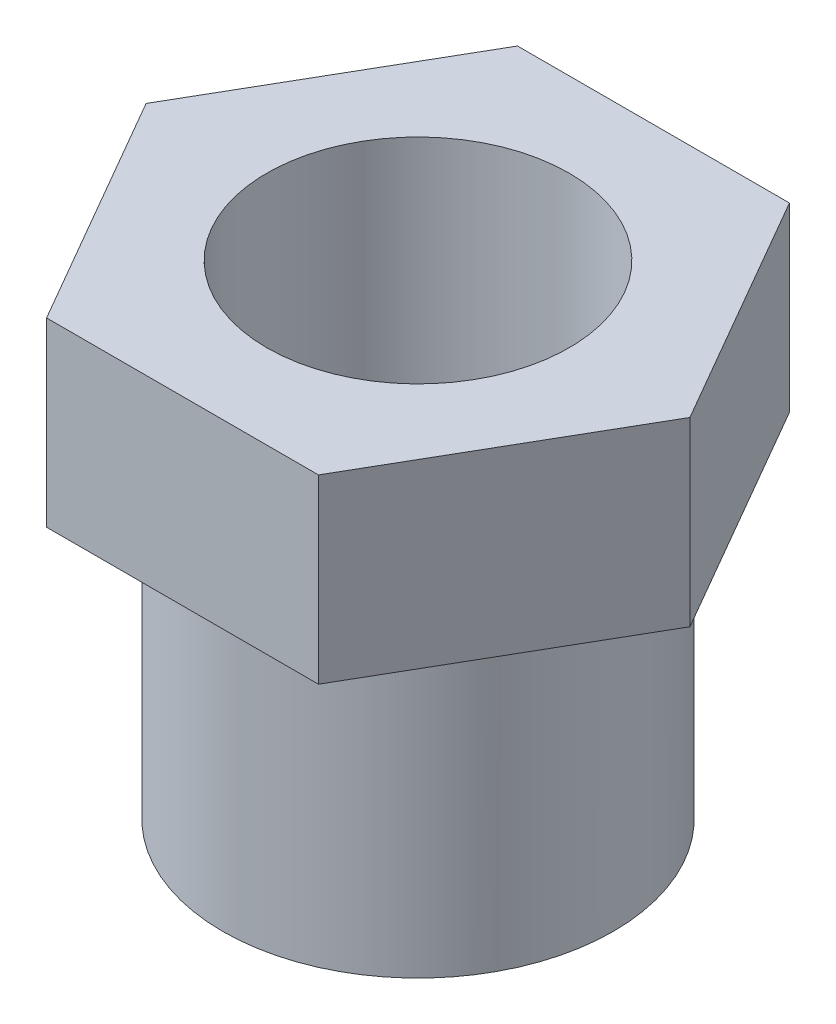
ISO-10303-21;
HEADER;
FILE_DESCRIPTION(('STEP AP214'),'2;1');
FILE_NAME('part.step','',(''),(''),'','','');
FILE_SCHEMA(('AUTOMOTIVE_DESIGN { 1 0 10303 214 1 1 1 1 }'));
ENDSEC;
DATA;
#1=APPLICATION_CONTEXT('core data for automotive mechanical design processes');
#2=APPLICATION_PROTOCOL_DEFINITION('international standard','automotive_design',2000,#1);
#3=PRODUCT_CONTEXT('',#1,'mechanical');
#4=PRODUCT('Part','Part','',(#3));
#5=PRODUCT_RELATED_PRODUCT_CATEGORY('part','',(#4));
#6=PRODUCT_DEFINITION_FORMATION('','',#4);
#7=PRODUCT_DEFINITION_CONTEXT('part definition',#1,'design');
#8=PRODUCT_DEFINITION('design','',#6,#7);
#9=PRODUCT_DEFINITION_SHAPE('','',#8);
#10=(LENGTH_UNIT() NAMED_UNIT(*) SI_UNIT(.MILLI.,.METRE.));
#11=(NAMED_UNIT(*) PLANE_ANGLE_UNIT() SI_UNIT($,.RADIAN.));
#12=(NAMED_UNIT(*) SI_UNIT($,.STERADIAN.) SOLID_ANGLE_UNIT());
#13=UNCERTAINTY_MEASURE_WITH_UNIT(LENGTH_MEASURE(1.E-05),#10,'distance_accuracy_value','');
#14=(GEOMETRIC_REPRESENTATION_CONTEXT(3) GLOBAL_UNCERTAINTY_ASSIGNED_CONTEXT((#13)) GLOBAL_UNIT_ASSIGNED_CONTEXT((#10,
#11,#12)) REPRESENTATION_CONTEXT('',''));
#15=CARTESIAN_POINT('',(0.,0.,0.));
#16=DIRECTION('',(0.,0.,1.));
#17=DIRECTION('',(1.,0.,0.));
#18=AXIS2_PLACEMENT_3D('',#15,#16,#17);
#19=CARTESIAN_POINT('',(0.,0.,0.));
#20=DIRECTION('',(0.,1.,0.));
#21=DIRECTION('',(0.,0.,1.));
#22=AXIS2_PLACEMENT_3D('',#19,#20,#21);
#23=PLANE('',#22);
#24=DIRECTION('',(0.499999999999995,0.,-0.866025403784441));
#25=VECTOR('',#24,1.);
#26=CARTESIAN_POINT('',(11.2500000000002,0.,19.4855715851497));
#27=LINE('',#26,#25);
#28=CARTESIAN_POINT('',(11.2500000000002,0.,19.4855715851497));
#29=VERTEX_POINT('',#28);
#30=CARTESIAN_POINT('',(22.5,0.,0.));
#31=VERTEX_POINT('',#30);
#32=EDGE_CURVE('E119',#29,#31,#27,.T.);
#33=ORIENTED_EDGE('',*,*,#32,.F.);
#34=DIRECTION('',(1.,0.,0.));
#35=VECTOR('',#34,1.);
#36=CARTESIAN_POINT('',(-11.2499999999998,0.,19.48557158515));
#37=LINE('',#36,#35);
#38=CARTESIAN_POINT('',(-11.2499999999998,0.,19.48557158515));
#39=VERTEX_POINT('',#38);
#40=EDGE_CURVE('E79',#39,#29,#37,.T.);
#41=ORIENTED_EDGE('',*,*,#40,.F.);
#42=DIRECTION('',(0.500000000000007,0.,0.866025403784434));
#43=VECTOR('',#42,1.);
#44=CARTESIAN_POINT('',(-22.5,0.,1.57116660247941E-13));
#45=LINE('',#44,#43);
#46=CARTESIAN_POINT('',(-22.5,0.,1.57116660247941E-13));
#47=VERTEX_POINT('',#46);
#48=EDGE_CURVE('E73',#47,#39,#45,.T.);
#49=ORIENTED_EDGE('',*,*,#48,.F.);
#50=DIRECTION('',(-0.499999999999995,0.,0.866025403784442));
#51=VECTOR('',#50,1.);
#52=CARTESIAN_POINT('',(-11.2500000000001,0.,-19.4855715851498));
#53=LINE('',#52,#51);
#54=CARTESIAN_POINT('',(-11.2500000000001,0.,-19.4855715851498));
#55=VERTEX_POINT('',#54);
#56=EDGE_CURVE('E109',#55,#47,#53,.T.);
#57=ORIENTED_EDGE('',*,*,#56,.F.);
#58=DIRECTION('',(-1.,0.,0.));
#59=VECTOR('',#58,1.);
#60=CARTESIAN_POINT('',(11.25,0.,-19.4855715851499));
#61=LINE('',#60,#59);
#62=CARTESIAN_POINT('',(11.25,0.,-19.4855715851499));
#63=VERTEX_POINT('',#62);
#64=EDGE_CURVE('E125',#63,#55,#61,.T.);
#65=ORIENTED_EDGE('',*,*,#64,.F.);
#66=DIRECTION('',(-0.500000000000001,0.,-0.866025403784438));
#67=VECTOR('',#66,1.);
#68=CARTESIAN_POINT('',(22.5,0.,0.));
#69=LINE('',#68,#67);
#70=EDGE_CURVE('E122',#31,#63,#69,.T.);
#71=ORIENTED_EDGE('',*,*,#70,.F.);
#72=EDGE_LOOP('',(#33,#41,#49,#57,#65,#71));
#73=FACE_BOUND('',#72,.T.);
#74=CARTESIAN_POINT('',(0.,0.,0.));
#75=DIRECTION('',(0.,1.,0.));
#76=DIRECTION('',(0.,0.,1.));
#77=AXIS2_PLACEMENT_3D('',#74,#75,#76);
#78=CIRCLE('',#77,16.1640409755687);
#79=CARTESIAN_POINT('',(0.,0.,16.1640409755687));
#80=VERTEX_POINT('',#79);
#81=EDGE_CURVE('E11',#80,#80,#78,.F.);
#82=ORIENTED_EDGE('',*,*,#81,.F.);
#83=EDGE_LOOP('',(#82));
#84=FACE_BOUND('',#83,.T.);
#85=ADVANCED_FACE('F32',(#73,#84),#23,.F.);
#86=CARTESIAN_POINT('',(11.2500000000002,15.,19.4855715851497));
#87=DIRECTION('',(-0.866025403784441,0.,-0.499999999999995));
#88=DIRECTION('',(-0.499999999999995,0.,0.866025403784442));
#89=AXIS2_PLACEMENT_3D('',#86,#87,#88);
#90=PLANE('',#89);
#91=ORIENTED_EDGE('',*,*,#32,.T.);
#92=DIRECTION('',(0.,-1.,0.));
#93=VECTOR('',#92,1.);
#94=CARTESIAN_POINT('',(22.5,15.,0.));
#95=LINE('',#94,#93);
#96=CARTESIAN_POINT('',(22.5,15.,0.));
#97=VERTEX_POINT('',#96);
#98=EDGE_CURVE('E42',#97,#31,#95,.T.);
#99=ORIENTED_EDGE('',*,*,#98,.F.);
#100=DIRECTION('',(0.499999999999995,0.,-0.866025403784441));
#101=VECTOR('',#100,1.);
#102=CARTESIAN_POINT('',(11.2500000000002,15.,19.4855715851497));
#103=LINE('',#102,#101);
#104=CARTESIAN_POINT('',(11.2500000000002,15.,19.4855715851497));
#105=VERTEX_POINT('',#104);
#106=EDGE_CURVE('E130',#105,#97,#103,.T.);
#107=ORIENTED_EDGE('',*,*,#106,.F.);
#108=DIRECTION('',(0.,-1.,0.));
#109=VECTOR('',#108,1.);
#110=CARTESIAN_POINT('',(11.2500000000002,15.,19.4855715851497));
#111=LINE('',#110,#109);
#112=EDGE_CURVE('E115',#105,#29,#111,.T.);
#113=ORIENTED_EDGE('',*,*,#112,.T.);
#114=EDGE_LOOP('',(#91,#99,#107,#113));
#115=FACE_BOUND('',#114,.T.);
#116=ADVANCED_FACE('F34',(#115),#90,.F.);
#117=CARTESIAN_POINT('',(22.5,15.,0.));
#118=DIRECTION('',(-0.866025403784438,0.,0.500000000000001));
#119=DIRECTION('',(0.500000000000001,0.,0.866025403784438));
#120=AXIS2_PLACEMENT_3D('',#117,#118,#119);
#121=PLANE('',#120);
#122=ORIENTED_EDGE('',*,*,#70,.T.);
#123=DIRECTION('',(0.,-1.,0.));
#124=VECTOR('',#123,1.);
#125=CARTESIAN_POINT('',(11.25,15.,-19.4855715851499));
#126=LINE('',#125,#124);
#127=CARTESIAN_POINT('',(11.25,15.,-19.4855715851499));
#128=VERTEX_POINT('',#127);
#129=EDGE_CURVE('E134',#128,#63,#126,.T.);
#130=ORIENTED_EDGE('',*,*,#129,.F.);
#131=DIRECTION('',(-0.500000000000001,0.,-0.866025403784438));
#132=VECTOR('',#131,1.);
#133=CARTESIAN_POINT('',(22.5,15.,0.));
#134=LINE('',#133,#132);
#135=EDGE_CURVE('E88',#97,#128,#134,.T.);
#136=ORIENTED_EDGE('',*,*,#135,.F.);
#137=ORIENTED_EDGE('',*,*,#98,.T.);
#138=EDGE_LOOP('',(#122,#130,#136,#137));
#139=FACE_BOUND('',#138,.T.);
#140=ADVANCED_FACE('F138',(#139),#121,.F.);
#141=CARTESIAN_POINT('',(11.25,15.,-19.4855715851499));
#142=DIRECTION('',(0.,0.,1.));
#143=DIRECTION('',(1.,0.,0.));
#144=AXIS2_PLACEMENT_3D('',#141,#142,#143);
#145=PLANE('',#144);
#146=ORIENTED_EDGE('',*,*,#64,.T.);
#147=DIRECTION('',(0.,-1.,0.));
#148=VECTOR('',#147,1.);
#149=CARTESIAN_POINT('',(-11.2500000000001,15.,-19.4855715851498));
#150=LINE('',#149,#148);
#151=CARTESIAN_POINT('',(-11.2500000000001,15.,-19.4855715851498));
#152=VERTEX_POINT('',#151);
#153=EDGE_CURVE('E110',#152,#55,#150,.T.);
#154=ORIENTED_EDGE('',*,*,#153,.F.);
#155=DIRECTION('',(-1.,0.,0.));
#156=VECTOR('',#155,1.);
#157=CARTESIAN_POINT('',(11.25,15.,-19.4855715851499));
#158=LINE('',#157,#156);
#159=EDGE_CURVE('E101',#128,#152,#158,.T.);
#160=ORIENTED_EDGE('',*,*,#159,.F.);
#161=ORIENTED_EDGE('',*,*,#129,.T.);
#162=EDGE_LOOP('',(#146,#154,#160,#161));
#163=FACE_BOUND('',#162,.T.);
#164=ADVANCED_FACE('F146',(#163),#145,.F.);
#165=CARTESIAN_POINT('',(-11.2500000000001,15.,-19.4855715851498));
#166=DIRECTION('',(0.866025403784442,0.,0.499999999999995));
#167=DIRECTION('',(0.499999999999995,0.,-0.866025403784442));
#168=AXIS2_PLACEMENT_3D('',#165,#166,#167);
#169=PLANE('',#168);
#170=ORIENTED_EDGE('',*,*,#56,.T.);
#171=DIRECTION('',(0.,-1.,0.));
#172=VECTOR('',#171,1.);
#173=CARTESIAN_POINT('',(-22.5,15.,1.57116660247941E-13));
#174=LINE('',#173,#172);
#175=CARTESIAN_POINT('',(-22.5,15.,1.57116660247941E-13));
#176=VERTEX_POINT('',#175);
#177=EDGE_CURVE('E106',#176,#47,#174,.T.);
#178=ORIENTED_EDGE('',*,*,#177,.F.);
#179=DIRECTION('',(-0.499999999999995,0.,0.866025403784442));
#180=VECTOR('',#179,1.);
#181=CARTESIAN_POINT('',(-11.2500000000001,15.,-19.4855715851498));
#182=LINE('',#181,#180);
#183=EDGE_CURVE('E95',#152,#176,#182,.T.);
#184=ORIENTED_EDGE('',*,*,#183,.F.);
#185=ORIENTED_EDGE('',*,*,#153,.T.);
#186=EDGE_LOOP('',(#170,#178,#184,#185));
#187=FACE_BOUND('',#186,.T.);
#188=ADVANCED_FACE('F107',(#187),#169,.F.);
#189=CARTESIAN_POINT('',(-22.5,15.,1.57116660247941E-13));
#190=DIRECTION('',(0.866025403784435,0.,-0.500000000000007));
#191=DIRECTION('',(-0.500000000000007,0.,-0.866025403784435));
#192=AXIS2_PLACEMENT_3D('',#189,#190,#191);
#193=PLANE('',#192);
#194=ORIENTED_EDGE('',*,*,#48,.T.);
#195=DIRECTION('',(0.,-1.,0.));
#196=VECTOR('',#195,1.);
#197=CARTESIAN_POINT('',(-11.2499999999998,15.,19.48557158515));
#198=LINE('',#197,#196);
#199=CARTESIAN_POINT('',(-11.2499999999998,15.,19.48557158515));
#200=VERTEX_POINT('',#199);
#201=EDGE_CURVE('E111',#200,#39,#198,.T.);
#202=ORIENTED_EDGE('',*,*,#201,.F.);
#203=DIRECTION('',(0.500000000000007,0.,0.866025403784434));
#204=VECTOR('',#203,1.);
#205=CARTESIAN_POINT('',(-22.5,15.,1.57116660247941E-13));
#206=LINE('',#205,#204);
#207=EDGE_CURVE('E99',#176,#200,#206,.T.);
#208=ORIENTED_EDGE('',*,*,#207,.F.);
#209=ORIENTED_EDGE('',*,*,#177,.T.);
#210=EDGE_LOOP('',(#194,#202,#208,#209));
#211=FACE_BOUND('',#210,.T.);
#212=ADVANCED_FACE('F113',(#211),#193,.F.);
#213=CARTESIAN_POINT('',(-11.2499999999998,15.,19.48557158515));
#214=DIRECTION('',(0.,0.,-1.));
#215=DIRECTION('',(-1.,0.,0.));
#216=AXIS2_PLACEMENT_3D('',#213,#214,#215);
#217=PLANE('',#216);
#218=ORIENTED_EDGE('',*,*,#40,.T.);
#219=ORIENTED_EDGE('',*,*,#112,.F.);
#220=DIRECTION('',(1.,0.,0.));
#221=VECTOR('',#220,1.);
#222=CARTESIAN_POINT('',(-11.2499999999998,15.,19.48557158515));
#223=LINE('',#222,#221);
#224=EDGE_CURVE('E50',#200,#105,#223,.T.);
#225=ORIENTED_EDGE('',*,*,#224,.F.);
#226=ORIENTED_EDGE('',*,*,#201,.T.);
#227=EDGE_LOOP('',(#218,#219,#225,#226));
#228=FACE_BOUND('',#227,.T.);
#229=ADVANCED_FACE('F180',(#228),#217,.F.);
#230=CARTESIAN_POINT('',(0.,15.,0.));
#231=DIRECTION('',(0.,1.,0.));
#232=DIRECTION('',(0.,0.,1.));
#233=AXIS2_PLACEMENT_3D('',#230,#231,#232);
#234=PLANE('',#233);
#235=CARTESIAN_POINT('',(0.,15.,0.));
#236=DIRECTION('',(0.,-1.,0.));
#237=DIRECTION('',(0.,0.,-1.));
#238=AXIS2_PLACEMENT_3D('',#235,#236,#237);
#239=CIRCLE('',#238,12.5140757707783);
#240=CARTESIAN_POINT('',(0.,15.,-12.5140757707783));
#241=VERTEX_POINT('',#240);
#242=EDGE_CURVE('E152',#241,#241,#239,.T.);
#243=ORIENTED_EDGE('',*,*,#242,.T.);
#244=EDGE_LOOP('',(#243));
#245=FACE_BOUND('',#244,.T.);
#246=ORIENTED_EDGE('',*,*,#106,.T.);
#247=ORIENTED_EDGE('',*,*,#135,.T.);
#248=ORIENTED_EDGE('',*,*,#159,.T.);
#249=ORIENTED_EDGE('',*,*,#183,.T.);
#250=ORIENTED_EDGE('',*,*,#207,.T.);
#251=ORIENTED_EDGE('',*,*,#224,.T.);
#252=EDGE_LOOP('',(#246,#247,#248,#249,#250,#251));
#253=FACE_BOUND('',#252,.T.);
#254=ADVANCED_FACE('F97',(#245,#253),#234,.T.);
#255=CARTESIAN_POINT('',(0.,-25.,0.));
#256=DIRECTION('',(0.,1.,0.));
#257=DIRECTION('',(0.,0.,1.));
#258=AXIS2_PLACEMENT_3D('',#255,#256,#257);
#259=CYLINDRICAL_SURFACE('',#258,16.1640409755687);
#260=CARTESIAN_POINT('',(0.,-25.,0.));
#261=DIRECTION('',(0.,-1.,0.));
#262=DIRECTION('',(0.,0.,-1.));
#263=AXIS2_PLACEMENT_3D('',#260,#261,#262);
#264=CIRCLE('',#263,16.1640409755687);
#265=CARTESIAN_POINT('',(0.,-25.,-16.1640409755687));
#266=VERTEX_POINT('',#265);
#267=EDGE_CURVE('E123',#266,#266,#264,.T.);
#268=ORIENTED_EDGE('',*,*,#267,.F.);
#269=EDGE_LOOP('',(#268));
#270=FACE_BOUND('',#269,.T.);
#271=ORIENTED_EDGE('',*,*,#81,.T.);
#272=EDGE_LOOP('',(#271));
#273=FACE_BOUND('',#272,.T.);
#274=ADVANCED_FACE('F165',(#270,#273),#259,.T.);
#275=CARTESIAN_POINT('',(0.,-25.,0.));
#276=DIRECTION('',(0.,-1.,0.));
#277=DIRECTION('',(0.,0.,-1.));
#278=AXIS2_PLACEMENT_3D('',#275,#276,#277);
#279=PLANE('',#278);
#280=CARTESIAN_POINT('',(0.,-25.,0.));
#281=DIRECTION('',(0.,-1.,0.));
#282=DIRECTION('',(0.,0.,-1.));
#283=AXIS2_PLACEMENT_3D('',#280,#281,#282);
#284=CIRCLE('',#283,12.5140757707783);
#285=CARTESIAN_POINT('',(0.,-25.,-12.5140757707783));
#286=VERTEX_POINT('',#285);
#287=EDGE_CURVE('E36',#286,#286,#284,.T.);
#288=ORIENTED_EDGE('',*,*,#287,.F.);
#289=EDGE_LOOP('',(#288));
#290=FACE_BOUND('',#289,.T.);
#291=ORIENTED_EDGE('',*,*,#267,.T.);
#292=EDGE_LOOP('',(#291));
#293=FACE_BOUND('',#292,.T.);
#294=ADVANCED_FACE('F162',(#290,#293),#279,.T.);
#295=CARTESIAN_POINT('',(0.,15.,0.));
#296=DIRECTION('',(0.,-1.,0.));
#297=DIRECTION('',(0.,0.,-1.));
#298=AXIS2_PLACEMENT_3D('',#295,#296,#297);
#299=CYLINDRICAL_SURFACE('',#298,12.5140757707783);
#300=ORIENTED_EDGE('',*,*,#287,.T.);
#301=EDGE_LOOP('',(#300));
#302=FACE_BOUND('',#301,.T.);
#303=ORIENTED_EDGE('',*,*,#242,.F.);
#304=EDGE_LOOP('',(#303));
#305=FACE_BOUND('',#304,.T.);
#306=ADVANCED_FACE('F159',(#302,#305),#299,.F.);
#307=CLOSED_SHELL('',(#85,#116,#140,#164,#188,#212,#229,#254,#274,#294,#306));
#308=MANIFOLD_SOLID_BREP('B2',#307);
#309=ADVANCED_BREP_SHAPE_REPRESENTATION('',(#18,#308),#14);
#310=SHAPE_DEFINITION_REPRESENTATION(#9,#309);
ENDSEC;
END-ISO-10303-21;
